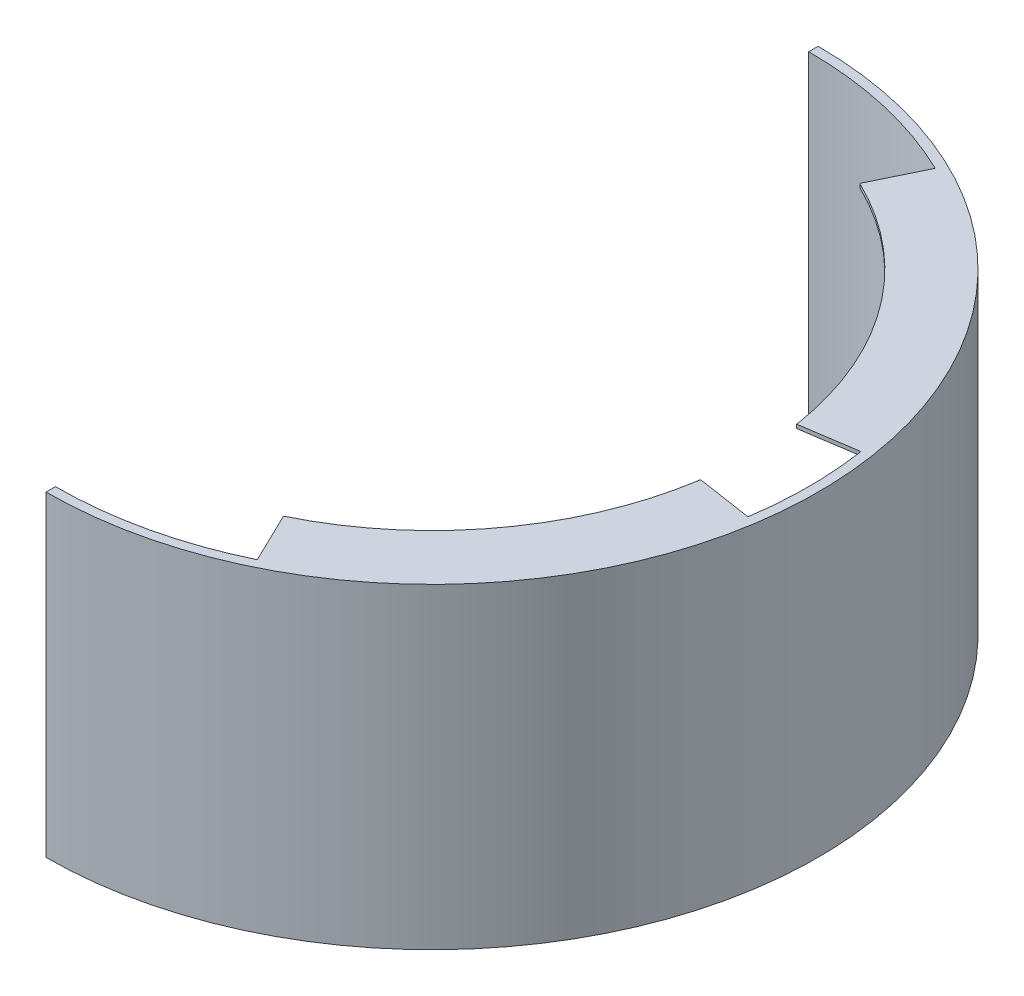
ISO-10303-21;
HEADER;
FILE_DESCRIPTION(('STEP AP214'),'2;1');
FILE_NAME('part.step','',(''),(''),'','','');
FILE_SCHEMA(('AUTOMOTIVE_DESIGN { 1 0 10303 214 1 1 1 1 }'));
ENDSEC;
DATA;
#1=APPLICATION_CONTEXT('core data for automotive mechanical design processes');
#2=APPLICATION_PROTOCOL_DEFINITION('international standard','automotive_design',2000,#1);
#3=PRODUCT_CONTEXT('',#1,'mechanical');
#4=PRODUCT('Part','Part','',(#3));
#5=PRODUCT_RELATED_PRODUCT_CATEGORY('part','',(#4));
#6=PRODUCT_DEFINITION_FORMATION('','',#4);
#7=PRODUCT_DEFINITION_CONTEXT('part definition',#1,'design');
#8=PRODUCT_DEFINITION('design','',#6,#7);
#9=PRODUCT_DEFINITION_SHAPE('','',#8);
#10=(LENGTH_UNIT() NAMED_UNIT(*) SI_UNIT(.MILLI.,.METRE.));
#11=(NAMED_UNIT(*) PLANE_ANGLE_UNIT() SI_UNIT($,.RADIAN.));
#12=(NAMED_UNIT(*) SI_UNIT($,.STERADIAN.) SOLID_ANGLE_UNIT());
#13=UNCERTAINTY_MEASURE_WITH_UNIT(LENGTH_MEASURE(1.E-05),#10,'distance_accuracy_value','');
#14=(GEOMETRIC_REPRESENTATION_CONTEXT(3) GLOBAL_UNCERTAINTY_ASSIGNED_CONTEXT((#13)) GLOBAL_UNIT_ASSIGNED_CONTEXT((#10,
#11,#12)) REPRESENTATION_CONTEXT('',''));
#15=CARTESIAN_POINT('',(0.,0.,0.));
#16=DIRECTION('',(0.,0.,1.));
#17=DIRECTION('',(1.,0.,0.));
#18=AXIS2_PLACEMENT_3D('',#15,#16,#17);
#19=CARTESIAN_POINT('',(0.,168.,0.));
#20=DIRECTION('',(0.,-1.,0.));
#21=DIRECTION('',(0.,0.,-1.));
#22=AXIS2_PLACEMENT_3D('',#19,#20,#21);
#23=CYLINDRICAL_SURFACE('',#22,200.);
#24=CARTESIAN_POINT('',(0.,168.,0.));
#25=DIRECTION('',(0.,-1.,0.));
#26=DIRECTION('',(0.,0.,1.));
#27=AXIS2_PLACEMENT_3D('',#24,#25,#26);
#28=CIRCLE('',#27,200.);
#29=CARTESIAN_POINT('',(197.737199332852,168.,-30.));
#30=VERTEX_POINT('',#29);
#31=CARTESIAN_POINT('',(197.737199332852,168.,30.));
#32=VERTEX_POINT('',#31);
#33=EDGE_CURVE('E202',#30,#32,#28,.T.);
#34=ORIENTED_EDGE('',*,*,#33,.F.);
#35=DIRECTION('',(0.,1.,0.));
#36=VECTOR('',#35,1.);
#37=CARTESIAN_POINT('',(197.737199332852,166.,-30.));
#38=LINE('',#37,#36);
#39=CARTESIAN_POINT('',(197.737199332852,166.,-30.));
#40=VERTEX_POINT('',#39);
#41=EDGE_CURVE('E196',#40,#30,#38,.T.);
#42=ORIENTED_EDGE('',*,*,#41,.F.);
#43=CARTESIAN_POINT('',(0.,166.,0.));
#44=DIRECTION('',(0.,1.,0.));
#45=DIRECTION('',(0.,0.,1.));
#46=AXIS2_PLACEMENT_3D('',#43,#44,#45);
#47=CIRCLE('',#46,200.);
#48=CARTESIAN_POINT('',(87.1779788708135,166.,-180.));
#49=VERTEX_POINT('',#48);
#50=EDGE_CURVE('E181',#40,#49,#47,.T.);
#51=ORIENTED_EDGE('',*,*,#50,.T.);
#52=DIRECTION('',(0.,1.,0.));
#53=VECTOR('',#52,1.);
#54=CARTESIAN_POINT('',(87.1779788708135,166.,-180.));
#55=LINE('',#54,#53);
#56=CARTESIAN_POINT('',(87.1779788708135,168.,-180.));
#57=VERTEX_POINT('',#56);
#58=EDGE_CURVE('E337',#49,#57,#55,.T.);
#59=ORIENTED_EDGE('',*,*,#58,.T.);
#60=CARTESIAN_POINT('',(0.,168.,-200.));
#61=VERTEX_POINT('',#60);
#62=EDGE_CURVE('E293',#61,#57,#28,.T.);
#63=ORIENTED_EDGE('',*,*,#62,.F.);
#64=DIRECTION('',(0.,-1.,0.));
#65=VECTOR('',#64,1.);
#66=CARTESIAN_POINT('',(0.,168.,-200.));
#67=LINE('',#66,#65);
#68=CARTESIAN_POINT('',(0.,0.,-200.));
#69=VERTEX_POINT('',#68);
#70=EDGE_CURVE('E303',#61,#69,#67,.T.);
#71=ORIENTED_EDGE('',*,*,#70,.T.);
#72=CARTESIAN_POINT('',(0.,0.,0.));
#73=DIRECTION('',(0.,-1.,0.));
#74=DIRECTION('',(0.,0.,1.));
#75=AXIS2_PLACEMENT_3D('',#72,#73,#74);
#76=CIRCLE('',#75,200.);
#77=CARTESIAN_POINT('',(87.1779788708135,0.,-180.));
#78=VERTEX_POINT('',#77);
#79=EDGE_CURVE('E304',#69,#78,#76,.T.);
#80=ORIENTED_EDGE('',*,*,#79,.T.);
#81=DIRECTION('',(0.,-1.,0.));
#82=VECTOR('',#81,1.);
#83=CARTESIAN_POINT('',(87.1779788708135,2.,-180.));
#84=LINE('',#83,#82);
#85=CARTESIAN_POINT('',(87.1779788708135,2.,-180.));
#86=VERTEX_POINT('',#85);
#87=EDGE_CURVE('E234',#86,#78,#84,.T.);
#88=ORIENTED_EDGE('',*,*,#87,.F.);
#89=CARTESIAN_POINT('',(0.,2.,0.));
#90=DIRECTION('',(0.,1.,0.));
#91=DIRECTION('',(0.,0.,1.));
#92=AXIS2_PLACEMENT_3D('',#89,#90,#91);
#93=CIRCLE('',#92,200.);
#94=CARTESIAN_POINT('',(197.737199332852,2.,-30.));
#95=VERTEX_POINT('',#94);
#96=EDGE_CURVE('E251',#95,#86,#93,.T.);
#97=ORIENTED_EDGE('',*,*,#96,.F.);
#98=DIRECTION('',(0.,-1.,0.));
#99=VECTOR('',#98,1.);
#100=CARTESIAN_POINT('',(197.737199332852,2.,-30.));
#101=LINE('',#100,#99);
#102=CARTESIAN_POINT('',(197.737199332852,0.,-30.));
#103=VERTEX_POINT('',#102);
#104=EDGE_CURVE('E243',#95,#103,#101,.T.);
#105=ORIENTED_EDGE('',*,*,#104,.T.);
#106=CARTESIAN_POINT('',(197.737199332852,0.,30.));
#107=VERTEX_POINT('',#106);
#108=EDGE_CURVE('E307',#103,#107,#76,.T.);
#109=ORIENTED_EDGE('',*,*,#108,.T.);
#110=DIRECTION('',(0.,-1.,0.));
#111=VECTOR('',#110,1.);
#112=CARTESIAN_POINT('',(197.737199332852,2.,30.));
#113=LINE('',#112,#111);
#114=CARTESIAN_POINT('',(197.737199332852,2.,30.));
#115=VERTEX_POINT('',#114);
#116=EDGE_CURVE('E289',#115,#107,#113,.T.);
#117=ORIENTED_EDGE('',*,*,#116,.F.);
#118=CARTESIAN_POINT('',(0.,2.,0.));
#119=DIRECTION('',(0.,1.,0.));
#120=DIRECTION('',(0.,0.,1.));
#121=AXIS2_PLACEMENT_3D('',#118,#119,#120);
#122=CIRCLE('',#121,200.);
#123=CARTESIAN_POINT('',(87.1779788708135,2.,180.));
#124=VERTEX_POINT('',#123);
#125=EDGE_CURVE('E264',#124,#115,#122,.T.);
#126=ORIENTED_EDGE('',*,*,#125,.F.);
#127=DIRECTION('',(0.,-1.,0.));
#128=VECTOR('',#127,1.);
#129=CARTESIAN_POINT('',(87.1779788708135,2.,180.));
#130=LINE('',#129,#128);
#131=CARTESIAN_POINT('',(87.1779788708135,0.,180.));
#132=VERTEX_POINT('',#131);
#133=EDGE_CURVE('E275',#124,#132,#130,.T.);
#134=ORIENTED_EDGE('',*,*,#133,.T.);
#135=CARTESIAN_POINT('',(0.,0.,200.));
#136=VERTEX_POINT('',#135);
#137=EDGE_CURVE('E292',#132,#136,#76,.T.);
#138=ORIENTED_EDGE('',*,*,#137,.T.);
#139=DIRECTION('',(0.,-1.,0.));
#140=VECTOR('',#139,1.);
#141=CARTESIAN_POINT('',(0.,168.,200.));
#142=LINE('',#141,#140);
#143=CARTESIAN_POINT('',(0.,168.,200.));
#144=VERTEX_POINT('',#143);
#145=EDGE_CURVE('E11',#144,#136,#142,.T.);
#146=ORIENTED_EDGE('',*,*,#145,.F.);
#147=CARTESIAN_POINT('',(87.1779788708135,168.,180.));
#148=VERTEX_POINT('',#147);
#149=EDGE_CURVE('E297',#148,#144,#28,.T.);
#150=ORIENTED_EDGE('',*,*,#149,.F.);
#151=DIRECTION('',(0.,1.,0.));
#152=VECTOR('',#151,1.);
#153=CARTESIAN_POINT('',(87.1779788708135,166.,180.));
#154=LINE('',#153,#152);
#155=CARTESIAN_POINT('',(87.1779788708135,166.,180.));
#156=VERTEX_POINT('',#155);
#157=EDGE_CURVE('E232',#156,#148,#154,.T.);
#158=ORIENTED_EDGE('',*,*,#157,.F.);
#159=CARTESIAN_POINT('',(0.,166.,0.));
#160=DIRECTION('',(0.,1.,0.));
#161=DIRECTION('',(0.,0.,1.));
#162=AXIS2_PLACEMENT_3D('',#159,#160,#161);
#163=CIRCLE('',#162,200.);
#164=CARTESIAN_POINT('',(197.737199332852,166.,30.));
#165=VERTEX_POINT('',#164);
#166=EDGE_CURVE('E210',#156,#165,#163,.T.);
#167=ORIENTED_EDGE('',*,*,#166,.T.);
#168=DIRECTION('',(0.,1.,0.));
#169=VECTOR('',#168,1.);
#170=CARTESIAN_POINT('',(197.737199332852,166.,30.));
#171=LINE('',#170,#169);
#172=EDGE_CURVE('E222',#165,#32,#171,.T.);
#173=ORIENTED_EDGE('',*,*,#172,.T.);
#174=EDGE_LOOP('',(#34,#42,#51,#59,#63,#71,#80,#88,#97,#105,#109,#117,#126,#134,#138,#146,#150,
#158,#167,#173));
#175=FACE_BOUND('',#174,.T.);
#176=ADVANCED_FACE('F43',(#175),#23,.F.);
#177=CARTESIAN_POINT('',(0.,168.,200.));
#178=DIRECTION('',(1.,0.,0.));
#179=DIRECTION('',(0.,0.,-1.));
#180=AXIS2_PLACEMENT_3D('',#177,#178,#179);
#181=PLANE('',#180);
#182=DIRECTION('',(0.,0.,1.));
#183=VECTOR('',#182,1.);
#184=CARTESIAN_POINT('',(0.,0.,200.));
#185=LINE('',#184,#183);
#186=CARTESIAN_POINT('',(0.,0.,205.));
#187=VERTEX_POINT('',#186);
#188=EDGE_CURVE('E306',#136,#187,#185,.T.);
#189=ORIENTED_EDGE('',*,*,#188,.T.);
#190=DIRECTION('',(0.,-1.,0.));
#191=VECTOR('',#190,1.);
#192=CARTESIAN_POINT('',(0.,168.,205.));
#193=LINE('',#192,#191);
#194=CARTESIAN_POINT('',(0.,168.,205.));
#195=VERTEX_POINT('',#194);
#196=EDGE_CURVE('E50',#195,#187,#193,.T.);
#197=ORIENTED_EDGE('',*,*,#196,.F.);
#198=DIRECTION('',(0.,0.,1.));
#199=VECTOR('',#198,1.);
#200=CARTESIAN_POINT('',(0.,168.,200.));
#201=LINE('',#200,#199);
#202=EDGE_CURVE('E296',#144,#195,#201,.T.);
#203=ORIENTED_EDGE('',*,*,#202,.F.);
#204=ORIENTED_EDGE('',*,*,#145,.T.);
#205=EDGE_LOOP('',(#189,#197,#203,#204));
#206=FACE_BOUND('',#205,.T.);
#207=ADVANCED_FACE('F342',(#206),#181,.F.);
#208=CARTESIAN_POINT('',(0.,168.,0.));
#209=DIRECTION('',(0.,-1.,0.));
#210=DIRECTION('',(0.,0.,-1.));
#211=AXIS2_PLACEMENT_3D('',#208,#209,#210);
#212=CYLINDRICAL_SURFACE('',#211,205.);
#213=CARTESIAN_POINT('',(0.,0.,0.));
#214=DIRECTION('',(0.,1.,0.));
#215=DIRECTION('',(0.,0.,1.));
#216=AXIS2_PLACEMENT_3D('',#213,#214,#215);
#217=CIRCLE('',#216,205.);
#218=CARTESIAN_POINT('',(0.,0.,-205.));
#219=VERTEX_POINT('',#218);
#220=EDGE_CURVE('E309',#187,#219,#217,.T.);
#221=ORIENTED_EDGE('',*,*,#220,.T.);
#222=DIRECTION('',(0.,-1.,0.));
#223=VECTOR('',#222,1.);
#224=CARTESIAN_POINT('',(0.,168.,-205.));
#225=LINE('',#224,#223);
#226=CARTESIAN_POINT('',(0.,168.,-205.));
#227=VERTEX_POINT('',#226);
#228=EDGE_CURVE('E315',#227,#219,#225,.T.);
#229=ORIENTED_EDGE('',*,*,#228,.F.);
#230=CARTESIAN_POINT('',(0.,168.,0.));
#231=DIRECTION('',(0.,1.,0.));
#232=DIRECTION('',(0.,0.,1.));
#233=AXIS2_PLACEMENT_3D('',#230,#231,#232);
#234=CIRCLE('',#233,205.);
#235=EDGE_CURVE('E299',#195,#227,#234,.T.);
#236=ORIENTED_EDGE('',*,*,#235,.F.);
#237=ORIENTED_EDGE('',*,*,#196,.T.);
#238=EDGE_LOOP('',(#221,#229,#236,#237));
#239=FACE_BOUND('',#238,.T.);
#240=ADVANCED_FACE('F322',(#239),#212,.T.);
#241=CARTESIAN_POINT('',(0.,168.,-205.));
#242=DIRECTION('',(1.,0.,0.));
#243=DIRECTION('',(0.,0.,-1.));
#244=AXIS2_PLACEMENT_3D('',#241,#242,#243);
#245=PLANE('',#244);
#246=DIRECTION('',(0.,0.,1.));
#247=VECTOR('',#246,1.);
#248=CARTESIAN_POINT('',(0.,0.,-205.));
#249=LINE('',#248,#247);
#250=EDGE_CURVE('E311',#219,#69,#249,.T.);
#251=ORIENTED_EDGE('',*,*,#250,.T.);
#252=ORIENTED_EDGE('',*,*,#70,.F.);
#253=DIRECTION('',(0.,0.,1.));
#254=VECTOR('',#253,1.);
#255=CARTESIAN_POINT('',(0.,168.,-205.));
#256=LINE('',#255,#254);
#257=EDGE_CURVE('E301',#227,#61,#256,.T.);
#258=ORIENTED_EDGE('',*,*,#257,.F.);
#259=ORIENTED_EDGE('',*,*,#228,.T.);
#260=EDGE_LOOP('',(#251,#252,#258,#259));
#261=FACE_BOUND('',#260,.T.);
#262=ADVANCED_FACE('F334',(#261),#245,.F.);
#263=CARTESIAN_POINT('',(0.,168.,0.));
#264=DIRECTION('',(0.,1.,0.));
#265=DIRECTION('',(0.,0.,1.));
#266=AXIS2_PLACEMENT_3D('',#263,#264,#265);
#267=PLANE('',#266);
#268=ORIENTED_EDGE('',*,*,#62,.T.);
#269=DIRECTION('',(-0.435889894354068,0.,0.9));
#270=VECTOR('',#269,1.);
#271=CARTESIAN_POINT('',(87.1779788708135,168.,-180.));
#272=LINE('',#271,#270);
#273=CARTESIAN_POINT('',(74.1012820401915,168.,-153.));
#274=VERTEX_POINT('',#273);
#275=EDGE_CURVE('E192',#57,#274,#272,.T.);
#276=ORIENTED_EDGE('',*,*,#275,.T.);
#277=CARTESIAN_POINT('',(0.,168.,0.));
#278=DIRECTION('',(0.,-1.,0.));
#279=DIRECTION('',(0.,0.,1.));
#280=AXIS2_PLACEMENT_3D('',#277,#278,#279);
#281=CIRCLE('',#280,170.);
#282=CARTESIAN_POINT('',(168.076619432924,168.,-25.5));
#283=VERTEX_POINT('',#282);
#284=EDGE_CURVE('E573',#274,#283,#281,.T.);
#285=ORIENTED_EDGE('',*,*,#284,.T.);
#286=DIRECTION('',(0.988685996664259,0.,-0.15));
#287=VECTOR('',#286,1.);
#288=CARTESIAN_POINT('',(197.737199332852,168.,-30.));
#289=LINE('',#288,#287);
#290=EDGE_CURVE('E57',#283,#30,#289,.T.);
#291=ORIENTED_EDGE('',*,*,#290,.T.);
#292=ORIENTED_EDGE('',*,*,#33,.T.);
#293=DIRECTION('',(-0.988685996664259,0.,-0.15));
#294=VECTOR('',#293,1.);
#295=CARTESIAN_POINT('',(197.737199332852,168.,30.));
#296=LINE('',#295,#294);
#297=CARTESIAN_POINT('',(168.076619432924,168.,25.5));
#298=VERTEX_POINT('',#297);
#299=EDGE_CURVE('E214',#32,#298,#296,.T.);
#300=ORIENTED_EDGE('',*,*,#299,.T.);
#301=CARTESIAN_POINT('',(0.,168.,0.));
#302=DIRECTION('',(0.,-1.,0.));
#303=DIRECTION('',(0.,0.,1.));
#304=AXIS2_PLACEMENT_3D('',#301,#302,#303);
#305=CIRCLE('',#304,170.);
#306=CARTESIAN_POINT('',(74.1012820401915,168.,153.));
#307=VERTEX_POINT('',#306);
#308=EDGE_CURVE('E204',#298,#307,#305,.T.);
#309=ORIENTED_EDGE('',*,*,#308,.T.);
#310=DIRECTION('',(0.435889894354068,0.,0.9));
#311=VECTOR('',#310,1.);
#312=CARTESIAN_POINT('',(87.1779788708135,168.,180.));
#313=LINE('',#312,#311);
#314=EDGE_CURVE('E64',#307,#148,#313,.T.);
#315=ORIENTED_EDGE('',*,*,#314,.T.);
#316=ORIENTED_EDGE('',*,*,#149,.T.);
#317=ORIENTED_EDGE('',*,*,#202,.T.);
#318=ORIENTED_EDGE('',*,*,#235,.T.);
#319=ORIENTED_EDGE('',*,*,#257,.T.);
#320=EDGE_LOOP('',(#268,#276,#285,#291,#292,#300,#309,#315,#316,#317,#318,#319));
#321=FACE_BOUND('',#320,.T.);
#322=ADVANCED_FACE('F339',(#321),#267,.T.);
#323=CARTESIAN_POINT('',(0.,0.,0.));
#324=DIRECTION('',(0.,1.,0.));
#325=DIRECTION('',(0.,0.,1.));
#326=AXIS2_PLACEMENT_3D('',#323,#324,#325);
#327=PLANE('',#326);
#328=ORIENTED_EDGE('',*,*,#79,.F.);
#329=ORIENTED_EDGE('',*,*,#250,.F.);
#330=ORIENTED_EDGE('',*,*,#220,.F.);
#331=ORIENTED_EDGE('',*,*,#188,.F.);
#332=ORIENTED_EDGE('',*,*,#137,.F.);
#333=DIRECTION('',(0.435889894354068,0.,0.9));
#334=VECTOR('',#333,1.);
#335=CARTESIAN_POINT('',(87.1779788708135,0.,180.));
#336=LINE('',#335,#334);
#337=CARTESIAN_POINT('',(74.1012820401915,0.,153.));
#338=VERTEX_POINT('',#337);
#339=EDGE_CURVE('E268',#338,#132,#336,.T.);
#340=ORIENTED_EDGE('',*,*,#339,.F.);
#341=CARTESIAN_POINT('',(0.,0.,0.));
#342=DIRECTION('',(0.,-1.,0.));
#343=DIRECTION('',(0.,0.,1.));
#344=AXIS2_PLACEMENT_3D('',#341,#342,#343);
#345=CIRCLE('',#344,170.);
#346=CARTESIAN_POINT('',(168.076619432924,0.,25.5));
#347=VERTEX_POINT('',#346);
#348=EDGE_CURVE('E277',#347,#338,#345,.T.);
#349=ORIENTED_EDGE('',*,*,#348,.F.);
#350=DIRECTION('',(-0.988685996664259,0.,-0.15));
#351=VECTOR('',#350,1.);
#352=CARTESIAN_POINT('',(197.737199332852,0.,30.));
#353=LINE('',#352,#351);
#354=EDGE_CURVE('E255',#107,#347,#353,.T.);
#355=ORIENTED_EDGE('',*,*,#354,.F.);
#356=ORIENTED_EDGE('',*,*,#108,.F.);
#357=DIRECTION('',(0.988685996664259,0.,-0.15));
#358=VECTOR('',#357,1.);
#359=CARTESIAN_POINT('',(197.737199332852,0.,-30.));
#360=LINE('',#359,#358);
#361=CARTESIAN_POINT('',(168.076619432924,0.,-25.5));
#362=VERTEX_POINT('',#361);
#363=EDGE_CURVE('E247',#362,#103,#360,.T.);
#364=ORIENTED_EDGE('',*,*,#363,.F.);
#365=CARTESIAN_POINT('',(0.,0.,0.));
#366=DIRECTION('',(0.,-1.,0.));
#367=DIRECTION('',(0.,0.,1.));
#368=AXIS2_PLACEMENT_3D('',#365,#366,#367);
#369=CIRCLE('',#368,170.);
#370=CARTESIAN_POINT('',(74.1012820401915,0.,-153.));
#371=VERTEX_POINT('',#370);
#372=EDGE_CURVE('E250',#371,#362,#369,.T.);
#373=ORIENTED_EDGE('',*,*,#372,.F.);
#374=DIRECTION('',(-0.435889894354068,0.,0.9));
#375=VECTOR('',#374,1.);
#376=CARTESIAN_POINT('',(87.1779788708135,0.,-180.));
#377=LINE('',#376,#375);
#378=EDGE_CURVE('E253',#78,#371,#377,.T.);
#379=ORIENTED_EDGE('',*,*,#378,.F.);
#380=EDGE_LOOP('',(#328,#329,#330,#331,#332,#340,#349,#355,#356,#364,#373,#379));
#381=FACE_BOUND('',#380,.T.);
#382=ADVANCED_FACE('F330',(#381),#327,.F.);
#383=CARTESIAN_POINT('',(197.737199332852,2.,30.));
#384=DIRECTION('',(-0.15,0.,0.988685996664259));
#385=DIRECTION('',(0.98868599666426,0.,0.15));
#386=AXIS2_PLACEMENT_3D('',#383,#384,#385);
#387=PLANE('',#386);
#388=ORIENTED_EDGE('',*,*,#354,.T.);
#389=DIRECTION('',(0.,-1.,0.));
#390=VECTOR('',#389,1.);
#391=CARTESIAN_POINT('',(168.076619432924,2.,25.5));
#392=LINE('',#391,#390);
#393=CARTESIAN_POINT('',(168.076619432924,2.,25.5));
#394=VERTEX_POINT('',#393);
#395=EDGE_CURVE('E286',#394,#347,#392,.T.);
#396=ORIENTED_EDGE('',*,*,#395,.F.);
#397=DIRECTION('',(-0.988685996664259,0.,-0.15));
#398=VECTOR('',#397,1.);
#399=CARTESIAN_POINT('',(197.737199332852,2.,30.));
#400=LINE('',#399,#398);
#401=EDGE_CURVE('E267',#115,#394,#400,.T.);
#402=ORIENTED_EDGE('',*,*,#401,.F.);
#403=ORIENTED_EDGE('',*,*,#116,.T.);
#404=EDGE_LOOP('',(#388,#396,#402,#403));
#405=FACE_BOUND('',#404,.T.);
#406=ADVANCED_FACE('F353',(#405),#387,.F.);
#407=CARTESIAN_POINT('',(0.,2.,0.));
#408=DIRECTION('',(0.,-1.,0.));
#409=DIRECTION('',(0.,0.,-1.));
#410=AXIS2_PLACEMENT_3D('',#407,#408,#409);
#411=CYLINDRICAL_SURFACE('',#410,170.);
#412=ORIENTED_EDGE('',*,*,#348,.T.);
#413=DIRECTION('',(0.,-1.,0.));
#414=VECTOR('',#413,1.);
#415=CARTESIAN_POINT('',(74.1012820401915,2.,153.));
#416=LINE('',#415,#414);
#417=CARTESIAN_POINT('',(74.1012820401915,2.,153.));
#418=VERTEX_POINT('',#417);
#419=EDGE_CURVE('E283',#418,#338,#416,.T.);
#420=ORIENTED_EDGE('',*,*,#419,.F.);
#421=CARTESIAN_POINT('',(0.,2.,0.));
#422=DIRECTION('',(0.,-1.,0.));
#423=DIRECTION('',(0.,0.,1.));
#424=AXIS2_PLACEMENT_3D('',#421,#422,#423);
#425=CIRCLE('',#424,170.);
#426=EDGE_CURVE('E270',#394,#418,#425,.T.);
#427=ORIENTED_EDGE('',*,*,#426,.F.);
#428=ORIENTED_EDGE('',*,*,#395,.T.);
#429=EDGE_LOOP('',(#412,#420,#427,#428));
#430=FACE_BOUND('',#429,.T.);
#431=ADVANCED_FACE('F362',(#430),#411,.F.);
#432=CARTESIAN_POINT('',(87.1779788708135,2.,180.));
#433=DIRECTION('',(0.9,0.,-0.435889894354068));
#434=DIRECTION('',(-0.435889894354068,0.,-0.9));
#435=AXIS2_PLACEMENT_3D('',#432,#433,#434);
#436=PLANE('',#435);
#437=ORIENTED_EDGE('',*,*,#339,.T.);
#438=ORIENTED_EDGE('',*,*,#133,.F.);
#439=DIRECTION('',(0.435889894354068,0.,0.9));
#440=VECTOR('',#439,1.);
#441=CARTESIAN_POINT('',(87.1779788708135,2.,180.));
#442=LINE('',#441,#440);
#443=EDGE_CURVE('E272',#418,#124,#442,.T.);
#444=ORIENTED_EDGE('',*,*,#443,.F.);
#445=ORIENTED_EDGE('',*,*,#419,.T.);
#446=EDGE_LOOP('',(#437,#438,#444,#445));
#447=FACE_BOUND('',#446,.T.);
#448=ADVANCED_FACE('F360',(#447),#436,.F.);
#449=CARTESIAN_POINT('',(0.,2.,0.));
#450=DIRECTION('',(0.,1.,0.));
#451=DIRECTION('',(0.,0.,1.));
#452=AXIS2_PLACEMENT_3D('',#449,#450,#451);
#453=PLANE('',#452);
#454=ORIENTED_EDGE('',*,*,#125,.T.);
#455=ORIENTED_EDGE('',*,*,#401,.T.);
#456=ORIENTED_EDGE('',*,*,#426,.T.);
#457=ORIENTED_EDGE('',*,*,#443,.T.);
#458=EDGE_LOOP('',(#454,#455,#456,#457));
#459=FACE_BOUND('',#458,.T.);
#460=ADVANCED_FACE('F356',(#459),#453,.T.);
#461=CARTESIAN_POINT('',(87.1779788708135,2.,-180.));
#462=DIRECTION('',(0.9,0.,0.435889894354068));
#463=DIRECTION('',(0.435889894354068,0.,-0.9));
#464=AXIS2_PLACEMENT_3D('',#461,#462,#463);
#465=PLANE('',#464);
#466=ORIENTED_EDGE('',*,*,#378,.T.);
#467=DIRECTION('',(0.,-1.,0.));
#468=VECTOR('',#467,1.);
#469=CARTESIAN_POINT('',(74.1012820401915,2.,-153.));
#470=LINE('',#469,#468);
#471=CARTESIAN_POINT('',(74.1012820401915,2.,-153.));
#472=VERTEX_POINT('',#471);
#473=EDGE_CURVE('E237',#472,#371,#470,.T.);
#474=ORIENTED_EDGE('',*,*,#473,.F.);
#475=DIRECTION('',(-0.435889894354068,0.,0.9));
#476=VECTOR('',#475,1.);
#477=CARTESIAN_POINT('',(87.1779788708135,2.,-180.));
#478=LINE('',#477,#476);
#479=EDGE_CURVE('E260',#86,#472,#478,.T.);
#480=ORIENTED_EDGE('',*,*,#479,.F.);
#481=ORIENTED_EDGE('',*,*,#87,.T.);
#482=EDGE_LOOP('',(#466,#474,#480,#481));
#483=FACE_BOUND('',#482,.T.);
#484=ADVANCED_FACE('F490',(#483),#465,.F.);
#485=CARTESIAN_POINT('',(0.,2.,0.));
#486=DIRECTION('',(0.,-1.,0.));
#487=DIRECTION('',(0.,0.,-1.));
#488=AXIS2_PLACEMENT_3D('',#485,#486,#487);
#489=CYLINDRICAL_SURFACE('',#488,170.);
#490=ORIENTED_EDGE('',*,*,#372,.T.);
#491=DIRECTION('',(0.,-1.,0.));
#492=VECTOR('',#491,1.);
#493=CARTESIAN_POINT('',(168.076619432924,2.,-25.5));
#494=LINE('',#493,#492);
#495=CARTESIAN_POINT('',(168.076619432924,2.,-25.5));
#496=VERTEX_POINT('',#495);
#497=EDGE_CURVE('E240',#496,#362,#494,.T.);
#498=ORIENTED_EDGE('',*,*,#497,.F.);
#499=CARTESIAN_POINT('',(0.,2.,0.));
#500=DIRECTION('',(0.,-1.,0.));
#501=DIRECTION('',(0.,0.,1.));
#502=AXIS2_PLACEMENT_3D('',#499,#500,#501);
#503=CIRCLE('',#502,170.);
#504=EDGE_CURVE('E258',#472,#496,#503,.T.);
#505=ORIENTED_EDGE('',*,*,#504,.F.);
#506=ORIENTED_EDGE('',*,*,#473,.T.);
#507=EDGE_LOOP('',(#490,#498,#505,#506));
#508=FACE_BOUND('',#507,.T.);
#509=ADVANCED_FACE('F481',(#508),#489,.F.);
#510=CARTESIAN_POINT('',(197.737199332852,2.,-30.));
#511=DIRECTION('',(-0.15,0.,-0.988685996664259));
#512=DIRECTION('',(-0.98868599666426,0.,0.15));
#513=AXIS2_PLACEMENT_3D('',#510,#511,#512);
#514=PLANE('',#513);
#515=ORIENTED_EDGE('',*,*,#363,.T.);
#516=ORIENTED_EDGE('',*,*,#104,.F.);
#517=DIRECTION('',(0.988685996664259,0.,-0.15));
#518=VECTOR('',#517,1.);
#519=CARTESIAN_POINT('',(197.737199332852,2.,-30.));
#520=LINE('',#519,#518);
#521=EDGE_CURVE('E246',#496,#95,#520,.T.);
#522=ORIENTED_EDGE('',*,*,#521,.F.);
#523=ORIENTED_EDGE('',*,*,#497,.T.);
#524=EDGE_LOOP('',(#515,#516,#522,#523));
#525=FACE_BOUND('',#524,.T.);
#526=ADVANCED_FACE('F472',(#525),#514,.F.);
#527=CARTESIAN_POINT('',(0.,2.,0.));
#528=DIRECTION('',(0.,1.,0.));
#529=DIRECTION('',(0.,0.,1.));
#530=AXIS2_PLACEMENT_3D('',#527,#528,#529);
#531=PLANE('',#530);
#532=ORIENTED_EDGE('',*,*,#96,.T.);
#533=ORIENTED_EDGE('',*,*,#479,.T.);
#534=ORIENTED_EDGE('',*,*,#504,.T.);
#535=ORIENTED_EDGE('',*,*,#521,.T.);
#536=EDGE_LOOP('',(#532,#533,#534,#535));
#537=FACE_BOUND('',#536,.T.);
#538=ADVANCED_FACE('F398',(#537),#531,.T.);
#539=CARTESIAN_POINT('',(87.1779788708135,166.,180.));
#540=DIRECTION('',(-0.9,0.,0.435889894354068));
#541=DIRECTION('',(0.435889894354068,0.,0.9));
#542=AXIS2_PLACEMENT_3D('',#539,#540,#541);
#543=PLANE('',#542);
#544=ORIENTED_EDGE('',*,*,#314,.F.);
#545=DIRECTION('',(0.,1.,0.));
#546=VECTOR('',#545,1.);
#547=CARTESIAN_POINT('',(74.1012820401915,166.,153.));
#548=LINE('',#547,#546);
#549=CARTESIAN_POINT('',(74.1012820401915,166.,153.));
#550=VERTEX_POINT('',#549);
#551=EDGE_CURVE('E230',#550,#307,#548,.T.);
#552=ORIENTED_EDGE('',*,*,#551,.F.);
#553=DIRECTION('',(0.435889894354068,0.,0.9));
#554=VECTOR('',#553,1.);
#555=CARTESIAN_POINT('',(87.1779788708135,166.,180.));
#556=LINE('',#555,#554);
#557=EDGE_CURVE('E213',#550,#156,#556,.T.);
#558=ORIENTED_EDGE('',*,*,#557,.T.);
#559=ORIENTED_EDGE('',*,*,#157,.T.);
#560=EDGE_LOOP('',(#544,#552,#558,#559));
#561=FACE_BOUND('',#560,.T.);
#562=ADVANCED_FACE('F394',(#561),#543,.T.);
#563=CARTESIAN_POINT('',(0.,166.,0.));
#564=DIRECTION('',(0.,1.,0.));
#565=DIRECTION('',(0.,0.,1.));
#566=AXIS2_PLACEMENT_3D('',#563,#564,#565);
#567=CYLINDRICAL_SURFACE('',#566,170.);
#568=ORIENTED_EDGE('',*,*,#308,.F.);
#569=DIRECTION('',(0.,1.,0.));
#570=VECTOR('',#569,1.);
#571=CARTESIAN_POINT('',(168.076619432924,166.,25.5));
#572=LINE('',#571,#570);
#573=CARTESIAN_POINT('',(168.076619432924,166.,25.5));
#574=VERTEX_POINT('',#573);
#575=EDGE_CURVE('E228',#574,#298,#572,.T.);
#576=ORIENTED_EDGE('',*,*,#575,.F.);
#577=CARTESIAN_POINT('',(0.,166.,0.));
#578=DIRECTION('',(0.,-1.,0.));
#579=DIRECTION('',(0.,0.,1.));
#580=AXIS2_PLACEMENT_3D('',#577,#578,#579);
#581=CIRCLE('',#580,170.);
#582=EDGE_CURVE('E217',#574,#550,#581,.T.);
#583=ORIENTED_EDGE('',*,*,#582,.T.);
#584=ORIENTED_EDGE('',*,*,#551,.T.);
#585=EDGE_LOOP('',(#568,#576,#583,#584));
#586=FACE_BOUND('',#585,.T.);
#587=ADVANCED_FACE('F397',(#586),#567,.F.);
#588=CARTESIAN_POINT('',(197.737199332852,166.,30.));
#589=DIRECTION('',(0.15,0.,-0.988685996664259));
#590=DIRECTION('',(-0.98868599666426,0.,-0.15));
#591=AXIS2_PLACEMENT_3D('',#588,#589,#590);
#592=PLANE('',#591);
#593=ORIENTED_EDGE('',*,*,#299,.F.);
#594=ORIENTED_EDGE('',*,*,#172,.F.);
#595=DIRECTION('',(-0.988685996664259,0.,-0.15));
#596=VECTOR('',#595,1.);
#597=CARTESIAN_POINT('',(197.737199332852,166.,30.));
#598=LINE('',#597,#596);
#599=EDGE_CURVE('E220',#165,#574,#598,.T.);
#600=ORIENTED_EDGE('',*,*,#599,.T.);
#601=ORIENTED_EDGE('',*,*,#575,.T.);
#602=EDGE_LOOP('',(#593,#594,#600,#601));
#603=FACE_BOUND('',#602,.T.);
#604=ADVANCED_FACE('F407',(#603),#592,.T.);
#605=CARTESIAN_POINT('',(0.,166.,0.));
#606=DIRECTION('',(0.,-1.,0.));
#607=DIRECTION('',(0.,0.,1.));
#608=AXIS2_PLACEMENT_3D('',#605,#606,#607);
#609=PLANE('',#608);
#610=ORIENTED_EDGE('',*,*,#166,.F.);
#611=ORIENTED_EDGE('',*,*,#557,.F.);
#612=ORIENTED_EDGE('',*,*,#582,.F.);
#613=ORIENTED_EDGE('',*,*,#599,.F.);
#614=EDGE_LOOP('',(#610,#611,#612,#613));
#615=FACE_BOUND('',#614,.T.);
#616=ADVANCED_FACE('F416',(#615),#609,.T.);
#617=CARTESIAN_POINT('',(197.737199332852,166.,-30.));
#618=DIRECTION('',(0.15,0.,0.988685996664259));
#619=DIRECTION('',(0.98868599666426,0.,-0.15));
#620=AXIS2_PLACEMENT_3D('',#617,#618,#619);
#621=PLANE('',#620);
#622=ORIENTED_EDGE('',*,*,#290,.F.);
#623=DIRECTION('',(0.,1.,0.));
#624=VECTOR('',#623,1.);
#625=CARTESIAN_POINT('',(168.076619432924,166.,-25.5));
#626=LINE('',#625,#624);
#627=CARTESIAN_POINT('',(168.076619432924,166.,-25.5));
#628=VERTEX_POINT('',#627);
#629=EDGE_CURVE('E198',#628,#283,#626,.T.);
#630=ORIENTED_EDGE('',*,*,#629,.F.);
#631=DIRECTION('',(0.988685996664259,0.,-0.15));
#632=VECTOR('',#631,1.);
#633=CARTESIAN_POINT('',(197.737199332852,166.,-30.));
#634=LINE('',#633,#632);
#635=EDGE_CURVE('E185',#628,#40,#634,.T.);
#636=ORIENTED_EDGE('',*,*,#635,.T.);
#637=ORIENTED_EDGE('',*,*,#41,.T.);
#638=EDGE_LOOP('',(#622,#630,#636,#637));
#639=FACE_BOUND('',#638,.T.);
#640=ADVANCED_FACE('F195',(#639),#621,.T.);
#641=CARTESIAN_POINT('',(0.,166.,0.));
#642=DIRECTION('',(0.,1.,0.));
#643=DIRECTION('',(0.,0.,1.));
#644=AXIS2_PLACEMENT_3D('',#641,#642,#643);
#645=CYLINDRICAL_SURFACE('',#644,170.);
#646=ORIENTED_EDGE('',*,*,#284,.F.);
#647=DIRECTION('',(0.,1.,0.));
#648=VECTOR('',#647,1.);
#649=CARTESIAN_POINT('',(74.1012820401915,166.,-153.));
#650=LINE('',#649,#648);
#651=CARTESIAN_POINT('',(74.1012820401915,166.,-153.));
#652=VERTEX_POINT('',#651);
#653=EDGE_CURVE('E206',#652,#274,#650,.T.);
#654=ORIENTED_EDGE('',*,*,#653,.F.);
#655=CARTESIAN_POINT('',(0.,166.,0.));
#656=DIRECTION('',(0.,-1.,0.));
#657=DIRECTION('',(0.,0.,1.));
#658=AXIS2_PLACEMENT_3D('',#655,#656,#657);
#659=CIRCLE('',#658,170.);
#660=EDGE_CURVE('E199',#652,#628,#659,.T.);
#661=ORIENTED_EDGE('',*,*,#660,.T.);
#662=ORIENTED_EDGE('',*,*,#629,.T.);
#663=EDGE_LOOP('',(#646,#654,#661,#662));
#664=FACE_BOUND('',#663,.T.);
#665=ADVANCED_FACE('F433',(#664),#645,.F.);
#666=CARTESIAN_POINT('',(87.1779788708135,166.,-180.));
#667=DIRECTION('',(-0.9,0.,-0.435889894354068));
#668=DIRECTION('',(-0.435889894354068,0.,0.9));
#669=AXIS2_PLACEMENT_3D('',#666,#667,#668);
#670=PLANE('',#669);
#671=ORIENTED_EDGE('',*,*,#275,.F.);
#672=ORIENTED_EDGE('',*,*,#58,.F.);
#673=DIRECTION('',(-0.435889894354068,0.,0.9));
#674=VECTOR('',#673,1.);
#675=CARTESIAN_POINT('',(87.1779788708135,166.,-180.));
#676=LINE('',#675,#674);
#677=EDGE_CURVE('E188',#49,#652,#676,.T.);
#678=ORIENTED_EDGE('',*,*,#677,.T.);
#679=ORIENTED_EDGE('',*,*,#653,.T.);
#680=EDGE_LOOP('',(#671,#672,#678,#679));
#681=FACE_BOUND('',#680,.T.);
#682=ADVANCED_FACE('F441',(#681),#670,.T.);
#683=CARTESIAN_POINT('',(0.,166.,0.));
#684=DIRECTION('',(0.,-1.,0.));
#685=DIRECTION('',(0.,0.,1.));
#686=AXIS2_PLACEMENT_3D('',#683,#684,#685);
#687=PLANE('',#686);
#688=ORIENTED_EDGE('',*,*,#50,.F.);
#689=ORIENTED_EDGE('',*,*,#635,.F.);
#690=ORIENTED_EDGE('',*,*,#660,.F.);
#691=ORIENTED_EDGE('',*,*,#677,.F.);
#692=EDGE_LOOP('',(#688,#689,#690,#691));
#693=FACE_BOUND('',#692,.T.);
#694=ADVANCED_FACE('F183',(#693),#687,.T.);
#695=CLOSED_SHELL('',(#176,#207,#240,#262,#322,#382,#406,#431,#448,#460,#484,#509,#526,#538,
#562,#587,#604,#616,#640,#665,#682,#694));
#696=MANIFOLD_SOLID_BREP('B2',#695);
#697=ADVANCED_BREP_SHAPE_REPRESENTATION('',(#18,#696),#14);
#698=SHAPE_DEFINITION_REPRESENTATION(#9,#697);
ENDSEC;
END-ISO-10303-21;
